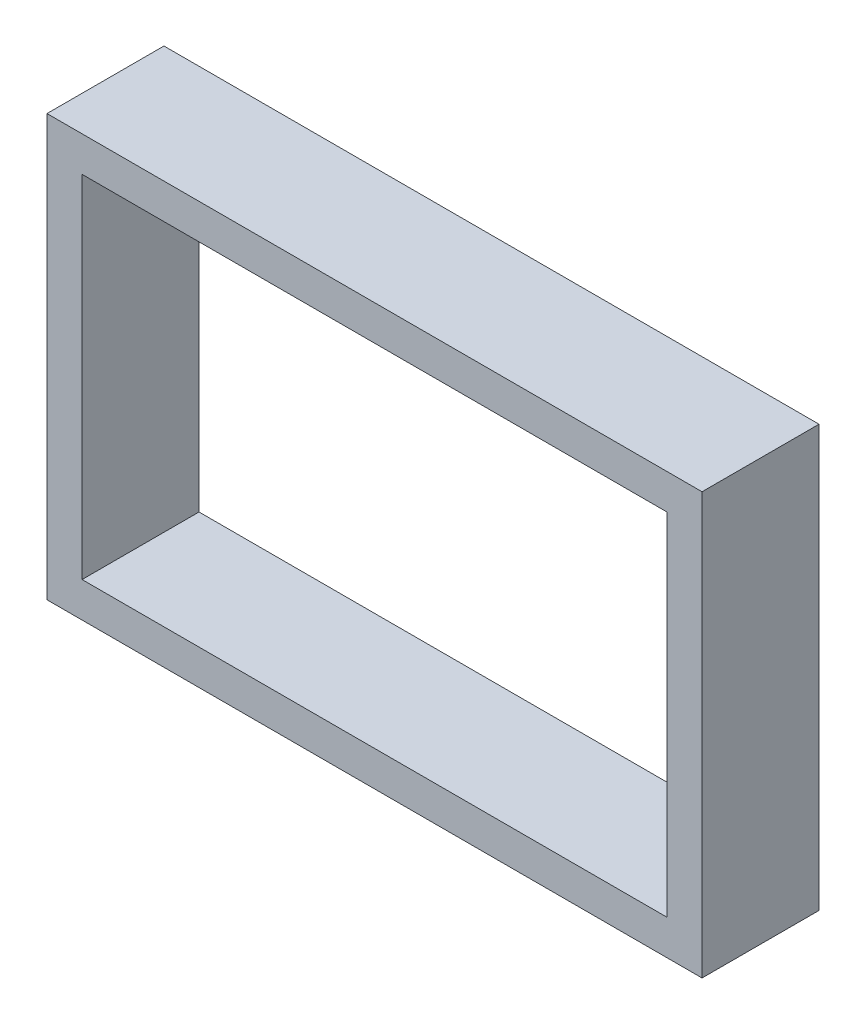
ISO-10303-21;
HEADER;
FILE_DESCRIPTION(('STEP AP214'),'2;1');
FILE_NAME('part.step','',(''),(''),'','','');
FILE_SCHEMA(('AUTOMOTIVE_DESIGN { 1 0 10303 214 1 1 1 1 }'));
ENDSEC;
DATA;
#1=APPLICATION_CONTEXT('core data for automotive mechanical design processes');
#2=APPLICATION_PROTOCOL_DEFINITION('international standard','automotive_design',2000,#1);
#3=PRODUCT_CONTEXT('',#1,'mechanical');
#4=PRODUCT('Part','Part','',(#3));
#5=PRODUCT_RELATED_PRODUCT_CATEGORY('part','',(#4));
#6=PRODUCT_DEFINITION_FORMATION('','',#4);
#7=PRODUCT_DEFINITION_CONTEXT('part definition',#1,'design');
#8=PRODUCT_DEFINITION('design','',#6,#7);
#9=PRODUCT_DEFINITION_SHAPE('','',#8);
#10=(LENGTH_UNIT() NAMED_UNIT(*) SI_UNIT(.MILLI.,.METRE.));
#11=(NAMED_UNIT(*) PLANE_ANGLE_UNIT() SI_UNIT($,.RADIAN.));
#12=(NAMED_UNIT(*) SI_UNIT($,.STERADIAN.) SOLID_ANGLE_UNIT());
#13=UNCERTAINTY_MEASURE_WITH_UNIT(LENGTH_MEASURE(1.E-05),#10,'distance_accuracy_value','');
#14=(GEOMETRIC_REPRESENTATION_CONTEXT(3) GLOBAL_UNCERTAINTY_ASSIGNED_CONTEXT((#13)) GLOBAL_UNIT_ASSIGNED_CONTEXT((#10,
#11,#12)) REPRESENTATION_CONTEXT('',''));
#15=CARTESIAN_POINT('',(0.,0.,0.));
#16=DIRECTION('',(0.,0.,1.));
#17=DIRECTION('',(1.,0.,0.));
#18=AXIS2_PLACEMENT_3D('',#15,#16,#17);
#19=CARTESIAN_POINT('',(0.,0.,10.));
#20=DIRECTION('',(0.,0.,1.));
#21=DIRECTION('',(1.,0.,0.));
#22=AXIS2_PLACEMENT_3D('',#19,#20,#21);
#23=PLANE('',#22);
#24=DIRECTION('',(0.,-1.,0.));
#25=VECTOR('',#24,1.);
#26=CARTESIAN_POINT('',(-28.,18.,10.));
#27=LINE('',#26,#25);
#28=CARTESIAN_POINT('',(-28.,18.,10.));
#29=VERTEX_POINT('',#28);
#30=CARTESIAN_POINT('',(-28.,-18.,10.));
#31=VERTEX_POINT('',#30);
#32=EDGE_CURVE('E137',#29,#31,#27,.T.);
#33=ORIENTED_EDGE('',*,*,#32,.T.);
#34=DIRECTION('',(1.,0.,0.));
#35=VECTOR('',#34,1.);
#36=CARTESIAN_POINT('',(-28.,-18.,10.));
#37=LINE('',#36,#35);
#38=CARTESIAN_POINT('',(28.,-18.,10.));
#39=VERTEX_POINT('',#38);
#40=EDGE_CURVE('E140',#31,#39,#37,.T.);
#41=ORIENTED_EDGE('',*,*,#40,.T.);
#42=DIRECTION('',(0.,1.,0.));
#43=VECTOR('',#42,1.);
#44=CARTESIAN_POINT('',(28.,18.,10.));
#45=LINE('',#44,#43);
#46=CARTESIAN_POINT('',(28.,18.,10.));
#47=VERTEX_POINT('',#46);
#48=EDGE_CURVE('E143',#39,#47,#45,.T.);
#49=ORIENTED_EDGE('',*,*,#48,.T.);
#50=DIRECTION('',(-1.,0.,0.));
#51=VECTOR('',#50,1.);
#52=CARTESIAN_POINT('',(-28.,18.,10.));
#53=LINE('',#52,#51);
#54=EDGE_CURVE('E145',#47,#29,#53,.T.);
#55=ORIENTED_EDGE('',*,*,#54,.T.);
#56=EDGE_LOOP('',(#33,#41,#49,#55));
#57=FACE_BOUND('',#56,.T.);
#58=DIRECTION('',(1.,0.,0.));
#59=VECTOR('',#58,1.);
#60=CARTESIAN_POINT('',(-25.,-15.,10.));
#61=LINE('',#60,#59);
#62=CARTESIAN_POINT('',(-25.,-15.,10.));
#63=VERTEX_POINT('',#62);
#64=CARTESIAN_POINT('',(25.,-15.,10.));
#65=VERTEX_POINT('',#64);
#66=EDGE_CURVE('E109',#63,#65,#61,.T.);
#67=ORIENTED_EDGE('',*,*,#66,.F.);
#68=DIRECTION('',(0.,-1.,0.));
#69=VECTOR('',#68,1.);
#70=CARTESIAN_POINT('',(-25.,15.,10.));
#71=LINE('',#70,#69);
#72=CARTESIAN_POINT('',(-25.,15.,10.));
#73=VERTEX_POINT('',#72);
#74=EDGE_CURVE('E101',#73,#63,#71,.T.);
#75=ORIENTED_EDGE('',*,*,#74,.F.);
#76=DIRECTION('',(-1.,0.,0.));
#77=VECTOR('',#76,1.);
#78=CARTESIAN_POINT('',(-25.,15.,10.));
#79=LINE('',#78,#77);
#80=CARTESIAN_POINT('',(25.,15.,10.));
#81=VERTEX_POINT('',#80);
#82=EDGE_CURVE('E123',#81,#73,#79,.T.);
#83=ORIENTED_EDGE('',*,*,#82,.F.);
#84=DIRECTION('',(0.,1.,0.));
#85=VECTOR('',#84,1.);
#86=CARTESIAN_POINT('',(25.,15.,10.));
#87=LINE('',#86,#85);
#88=EDGE_CURVE('E121',#65,#81,#87,.T.);
#89=ORIENTED_EDGE('',*,*,#88,.F.);
#90=EDGE_LOOP('',(#67,#75,#83,#89));
#91=FACE_BOUND('',#90,.T.);
#92=ADVANCED_FACE('F36',(#57,#91),#23,.T.);
#93=CARTESIAN_POINT('',(0.,0.,0.));
#94=DIRECTION('',(0.,0.,1.));
#95=DIRECTION('',(1.,0.,0.));
#96=AXIS2_PLACEMENT_3D('',#93,#94,#95);
#97=PLANE('',#96);
#98=DIRECTION('',(0.,-1.,0.));
#99=VECTOR('',#98,1.);
#100=CARTESIAN_POINT('',(-28.,18.,0.));
#101=LINE('',#100,#99);
#102=CARTESIAN_POINT('',(-28.,18.,0.));
#103=VERTEX_POINT('',#102);
#104=CARTESIAN_POINT('',(-28.,-18.,0.));
#105=VERTEX_POINT('',#104);
#106=EDGE_CURVE('E117',#103,#105,#101,.T.);
#107=ORIENTED_EDGE('',*,*,#106,.F.);
#108=DIRECTION('',(-1.,0.,0.));
#109=VECTOR('',#108,1.);
#110=CARTESIAN_POINT('',(-28.,18.,0.));
#111=LINE('',#110,#109);
#112=CARTESIAN_POINT('',(28.,18.,0.));
#113=VERTEX_POINT('',#112);
#114=EDGE_CURVE('E141',#113,#103,#111,.T.);
#115=ORIENTED_EDGE('',*,*,#114,.F.);
#116=DIRECTION('',(0.,1.,0.));
#117=VECTOR('',#116,1.);
#118=CARTESIAN_POINT('',(28.,18.,0.));
#119=LINE('',#118,#117);
#120=CARTESIAN_POINT('',(28.,-18.,0.));
#121=VERTEX_POINT('',#120);
#122=EDGE_CURVE('E152',#121,#113,#119,.T.);
#123=ORIENTED_EDGE('',*,*,#122,.F.);
#124=DIRECTION('',(1.,0.,0.));
#125=VECTOR('',#124,1.);
#126=CARTESIAN_POINT('',(-28.,-18.,0.));
#127=LINE('',#126,#125);
#128=EDGE_CURVE('E150',#105,#121,#127,.T.);
#129=ORIENTED_EDGE('',*,*,#128,.F.);
#130=EDGE_LOOP('',(#107,#115,#123,#129));
#131=FACE_BOUND('',#130,.T.);
#132=DIRECTION('',(0.,-1.,0.));
#133=VECTOR('',#132,1.);
#134=CARTESIAN_POINT('',(-25.,15.,0.));
#135=LINE('',#134,#133);
#136=CARTESIAN_POINT('',(-25.,15.,0.));
#137=VERTEX_POINT('',#136);
#138=CARTESIAN_POINT('',(-25.,-15.,0.));
#139=VERTEX_POINT('',#138);
#140=EDGE_CURVE('E59',#137,#139,#135,.T.);
#141=ORIENTED_EDGE('',*,*,#140,.T.);
#142=DIRECTION('',(1.,0.,0.));
#143=VECTOR('',#142,1.);
#144=CARTESIAN_POINT('',(-25.,-15.,0.));
#145=LINE('',#144,#143);
#146=CARTESIAN_POINT('',(25.,-15.,0.));
#147=VERTEX_POINT('',#146);
#148=EDGE_CURVE('E116',#139,#147,#145,.T.);
#149=ORIENTED_EDGE('',*,*,#148,.T.);
#150=DIRECTION('',(0.,1.,0.));
#151=VECTOR('',#150,1.);
#152=CARTESIAN_POINT('',(25.,15.,0.));
#153=LINE('',#152,#151);
#154=CARTESIAN_POINT('',(25.,15.,0.));
#155=VERTEX_POINT('',#154);
#156=EDGE_CURVE('E129',#147,#155,#153,.T.);
#157=ORIENTED_EDGE('',*,*,#156,.T.);
#158=DIRECTION('',(-1.,0.,0.));
#159=VECTOR('',#158,1.);
#160=CARTESIAN_POINT('',(-25.,15.,0.));
#161=LINE('',#160,#159);
#162=EDGE_CURVE('E110',#155,#137,#161,.T.);
#163=ORIENTED_EDGE('',*,*,#162,.T.);
#164=EDGE_LOOP('',(#141,#149,#157,#163));
#165=FACE_BOUND('',#164,.T.);
#166=ADVANCED_FACE('F170',(#131,#165),#97,.F.);
#167=CARTESIAN_POINT('',(-28.,18.,10.));
#168=DIRECTION('',(1.,0.,0.));
#169=DIRECTION('',(0.,0.,-1.));
#170=AXIS2_PLACEMENT_3D('',#167,#168,#169);
#171=PLANE('',#170);
#172=ORIENTED_EDGE('',*,*,#106,.T.);
#173=DIRECTION('',(0.,0.,-1.));
#174=VECTOR('',#173,1.);
#175=CARTESIAN_POINT('',(-28.,-18.,10.));
#176=LINE('',#175,#174);
#177=EDGE_CURVE('E11',#31,#105,#176,.T.);
#178=ORIENTED_EDGE('',*,*,#177,.F.);
#179=ORIENTED_EDGE('',*,*,#32,.F.);
#180=DIRECTION('',(0.,0.,-1.));
#181=VECTOR('',#180,1.);
#182=CARTESIAN_POINT('',(-28.,18.,10.));
#183=LINE('',#182,#181);
#184=EDGE_CURVE('E147',#29,#103,#183,.T.);
#185=ORIENTED_EDGE('',*,*,#184,.T.);
#186=EDGE_LOOP('',(#172,#178,#179,#185));
#187=FACE_BOUND('',#186,.T.);
#188=ADVANCED_FACE('F38',(#187),#171,.F.);
#189=CARTESIAN_POINT('',(-28.,-18.,10.));
#190=DIRECTION('',(0.,1.,0.));
#191=DIRECTION('',(0.,0.,1.));
#192=AXIS2_PLACEMENT_3D('',#189,#190,#191);
#193=PLANE('',#192);
#194=ORIENTED_EDGE('',*,*,#128,.T.);
#195=DIRECTION('',(0.,0.,-1.));
#196=VECTOR('',#195,1.);
#197=CARTESIAN_POINT('',(28.,-18.,10.));
#198=LINE('',#197,#196);
#199=EDGE_CURVE('E44',#39,#121,#198,.T.);
#200=ORIENTED_EDGE('',*,*,#199,.F.);
#201=ORIENTED_EDGE('',*,*,#40,.F.);
#202=ORIENTED_EDGE('',*,*,#177,.T.);
#203=EDGE_LOOP('',(#194,#200,#201,#202));
#204=FACE_BOUND('',#203,.T.);
#205=ADVANCED_FACE('F180',(#204),#193,.F.);
#206=CARTESIAN_POINT('',(28.,18.,10.));
#207=DIRECTION('',(-1.,0.,0.));
#208=DIRECTION('',(0.,-1.,0.));
#209=AXIS2_PLACEMENT_3D('',#206,#207,#208);
#210=PLANE('',#209);
#211=ORIENTED_EDGE('',*,*,#122,.T.);
#212=DIRECTION('',(0.,0.,-1.));
#213=VECTOR('',#212,1.);
#214=CARTESIAN_POINT('',(28.,18.,10.));
#215=LINE('',#214,#213);
#216=EDGE_CURVE('E157',#47,#113,#215,.T.);
#217=ORIENTED_EDGE('',*,*,#216,.F.);
#218=ORIENTED_EDGE('',*,*,#48,.F.);
#219=ORIENTED_EDGE('',*,*,#199,.T.);
#220=EDGE_LOOP('',(#211,#217,#218,#219));
#221=FACE_BOUND('',#220,.T.);
#222=ADVANCED_FACE('F164',(#221),#210,.F.);
#223=CARTESIAN_POINT('',(-28.,18.,10.));
#224=DIRECTION('',(0.,-1.,0.));
#225=DIRECTION('',(0.,0.,-1.));
#226=AXIS2_PLACEMENT_3D('',#223,#224,#225);
#227=PLANE('',#226);
#228=ORIENTED_EDGE('',*,*,#114,.T.);
#229=ORIENTED_EDGE('',*,*,#184,.F.);
#230=ORIENTED_EDGE('',*,*,#54,.F.);
#231=ORIENTED_EDGE('',*,*,#216,.T.);
#232=EDGE_LOOP('',(#228,#229,#230,#231));
#233=FACE_BOUND('',#232,.T.);
#234=ADVANCED_FACE('F174',(#233),#227,.F.);
#235=CARTESIAN_POINT('',(-25.,15.,10.));
#236=DIRECTION('',(1.,0.,0.));
#237=DIRECTION('',(0.,1.,0.));
#238=AXIS2_PLACEMENT_3D('',#235,#236,#237);
#239=PLANE('',#238);
#240=ORIENTED_EDGE('',*,*,#140,.F.);
#241=DIRECTION('',(0.,0.,-1.));
#242=VECTOR('',#241,1.);
#243=CARTESIAN_POINT('',(-25.,15.,10.));
#244=LINE('',#243,#242);
#245=EDGE_CURVE('E105',#73,#137,#244,.T.);
#246=ORIENTED_EDGE('',*,*,#245,.F.);
#247=ORIENTED_EDGE('',*,*,#74,.T.);
#248=DIRECTION('',(0.,0.,-1.));
#249=VECTOR('',#248,1.);
#250=CARTESIAN_POINT('',(-25.,-15.,10.));
#251=LINE('',#250,#249);
#252=EDGE_CURVE('E104',#63,#139,#251,.T.);
#253=ORIENTED_EDGE('',*,*,#252,.T.);
#254=EDGE_LOOP('',(#240,#246,#247,#253));
#255=FACE_BOUND('',#254,.T.);
#256=ADVANCED_FACE('F103',(#255),#239,.T.);
#257=CARTESIAN_POINT('',(-25.,-15.,10.));
#258=DIRECTION('',(0.,1.,0.));
#259=DIRECTION('',(0.,0.,1.));
#260=AXIS2_PLACEMENT_3D('',#257,#258,#259);
#261=PLANE('',#260);
#262=ORIENTED_EDGE('',*,*,#148,.F.);
#263=ORIENTED_EDGE('',*,*,#252,.F.);
#264=ORIENTED_EDGE('',*,*,#66,.T.);
#265=DIRECTION('',(0.,0.,-1.));
#266=VECTOR('',#265,1.);
#267=CARTESIAN_POINT('',(25.,-15.,10.));
#268=LINE('',#267,#266);
#269=EDGE_CURVE('E118',#65,#147,#268,.T.);
#270=ORIENTED_EDGE('',*,*,#269,.T.);
#271=EDGE_LOOP('',(#262,#263,#264,#270));
#272=FACE_BOUND('',#271,.T.);
#273=ADVANCED_FACE('F113',(#272),#261,.T.);
#274=CARTESIAN_POINT('',(25.,15.,10.));
#275=DIRECTION('',(-1.,0.,0.));
#276=DIRECTION('',(0.,-1.,0.));
#277=AXIS2_PLACEMENT_3D('',#274,#275,#276);
#278=PLANE('',#277);
#279=ORIENTED_EDGE('',*,*,#156,.F.);
#280=ORIENTED_EDGE('',*,*,#269,.F.);
#281=ORIENTED_EDGE('',*,*,#88,.T.);
#282=DIRECTION('',(0.,0.,-1.));
#283=VECTOR('',#282,1.);
#284=CARTESIAN_POINT('',(25.,15.,10.));
#285=LINE('',#284,#283);
#286=EDGE_CURVE('E51',#81,#155,#285,.T.);
#287=ORIENTED_EDGE('',*,*,#286,.T.);
#288=EDGE_LOOP('',(#279,#280,#281,#287));
#289=FACE_BOUND('',#288,.T.);
#290=ADVANCED_FACE('F203',(#289),#278,.T.);
#291=CARTESIAN_POINT('',(-25.,15.,10.));
#292=DIRECTION('',(0.,-1.,0.));
#293=DIRECTION('',(0.,0.,-1.));
#294=AXIS2_PLACEMENT_3D('',#291,#292,#293);
#295=PLANE('',#294);
#296=ORIENTED_EDGE('',*,*,#162,.F.);
#297=ORIENTED_EDGE('',*,*,#286,.F.);
#298=ORIENTED_EDGE('',*,*,#82,.T.);
#299=ORIENTED_EDGE('',*,*,#245,.T.);
#300=EDGE_LOOP('',(#296,#297,#298,#299));
#301=FACE_BOUND('',#300,.T.);
#302=ADVANCED_FACE('F207',(#301),#295,.T.);
#303=CLOSED_SHELL('',(#92,#166,#188,#205,#222,#234,#256,#273,#290,#302));
#304=MANIFOLD_SOLID_BREP('B2',#303);
#305=ADVANCED_BREP_SHAPE_REPRESENTATION('',(#18,#304),#14);
#306=SHAPE_DEFINITION_REPRESENTATION(#9,#305);
ENDSEC;
END-ISO-10303-21;
